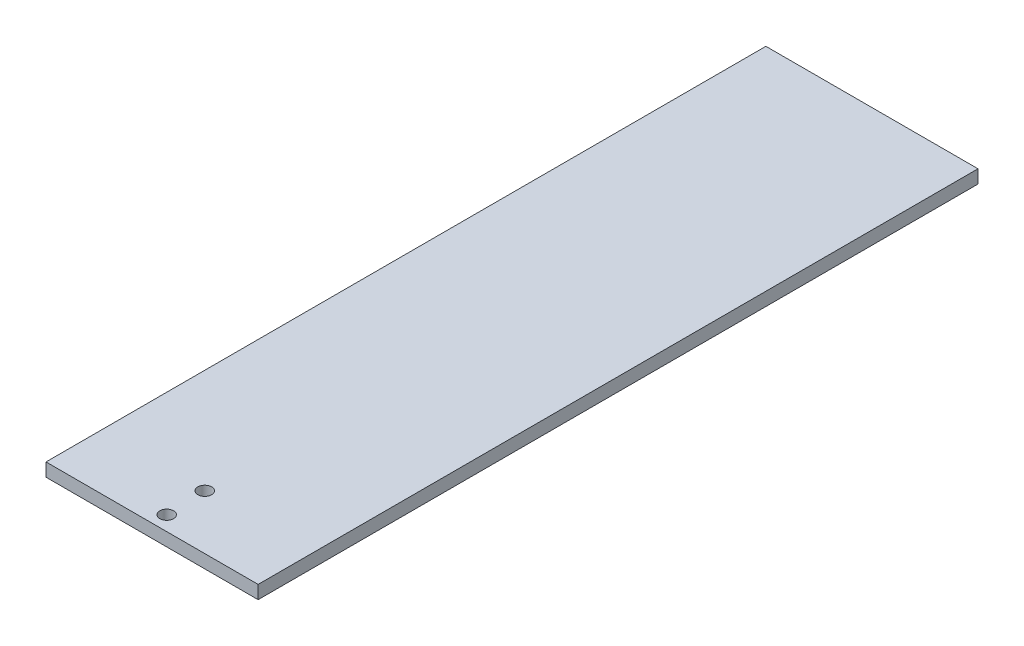
ISO-10303-21;
HEADER;
FILE_DESCRIPTION(('STEP AP214'),'2;1');
FILE_NAME('part.step','',(''),(''),'','','');
FILE_SCHEMA(('AUTOMOTIVE_DESIGN { 1 0 10303 214 1 1 1 1 }'));
ENDSEC;
DATA;
#1=APPLICATION_CONTEXT('core data for automotive mechanical design processes');
#2=APPLICATION_PROTOCOL_DEFINITION('international standard','automotive_design',2000,#1);
#3=PRODUCT_CONTEXT('',#1,'mechanical');
#4=PRODUCT('Part','Part','',(#3));
#5=PRODUCT_RELATED_PRODUCT_CATEGORY('part','',(#4));
#6=PRODUCT_DEFINITION_FORMATION('','',#4);
#7=PRODUCT_DEFINITION_CONTEXT('part definition',#1,'design');
#8=PRODUCT_DEFINITION('design','',#6,#7);
#9=PRODUCT_DEFINITION_SHAPE('','',#8);
#10=(LENGTH_UNIT() NAMED_UNIT(*) SI_UNIT(.MILLI.,.METRE.));
#11=(NAMED_UNIT(*) PLANE_ANGLE_UNIT() SI_UNIT($,.RADIAN.));
#12=(NAMED_UNIT(*) SI_UNIT($,.STERADIAN.) SOLID_ANGLE_UNIT());
#13=UNCERTAINTY_MEASURE_WITH_UNIT(LENGTH_MEASURE(1.E-05),#10,'distance_accuracy_value','');
#14=(GEOMETRIC_REPRESENTATION_CONTEXT(3) GLOBAL_UNCERTAINTY_ASSIGNED_CONTEXT((#13)) GLOBAL_UNIT_ASSIGNED_CONTEXT((#10,
#11,#12)) REPRESENTATION_CONTEXT('',''));
#15=CARTESIAN_POINT('',(0.,0.,0.));
#16=DIRECTION('',(0.,0.,1.));
#17=DIRECTION('',(1.,0.,0.));
#18=AXIS2_PLACEMENT_3D('',#15,#16,#17);
#19=CARTESIAN_POINT('',(0.,6.35,0.));
#20=DIRECTION('',(1.,0.,0.));
#21=DIRECTION('',(0.,0.,-1.));
#22=AXIS2_PLACEMENT_3D('',#19,#20,#21);
#23=PLANE('',#22);
#24=DIRECTION('',(0.,0.,1.));
#25=VECTOR('',#24,1.);
#26=CARTESIAN_POINT('',(0.,0.,0.));
#27=LINE('',#26,#25);
#28=CARTESIAN_POINT('',(0.,0.,-344.8));
#29=VERTEX_POINT('',#28);
#30=CARTESIAN_POINT('',(0.,0.,0.));
#31=VERTEX_POINT('',#30);
#32=EDGE_CURVE('E101',#29,#31,#27,.T.);
#33=ORIENTED_EDGE('',*,*,#32,.T.);
#34=DIRECTION('',(0.,-1.,0.));
#35=VECTOR('',#34,1.);
#36=CARTESIAN_POINT('',(0.,6.35,0.));
#37=LINE('',#36,#35);
#38=CARTESIAN_POINT('',(0.,6.35,0.));
#39=VERTEX_POINT('',#38);
#40=EDGE_CURVE('E11',#39,#31,#37,.T.);
#41=ORIENTED_EDGE('',*,*,#40,.F.);
#42=DIRECTION('',(0.,0.,1.));
#43=VECTOR('',#42,1.);
#44=CARTESIAN_POINT('',(0.,6.35,0.));
#45=LINE('',#44,#43);
#46=CARTESIAN_POINT('',(0.,6.35,-344.8));
#47=VERTEX_POINT('',#46);
#48=EDGE_CURVE('E89',#47,#39,#45,.T.);
#49=ORIENTED_EDGE('',*,*,#48,.F.);
#50=DIRECTION('',(0.,-1.,0.));
#51=VECTOR('',#50,1.);
#52=CARTESIAN_POINT('',(0.,6.35,-344.8));
#53=LINE('',#52,#51);
#54=EDGE_CURVE('E97',#47,#29,#53,.T.);
#55=ORIENTED_EDGE('',*,*,#54,.T.);
#56=EDGE_LOOP('',(#33,#41,#49,#55));
#57=FACE_BOUND('',#56,.T.);
#58=ADVANCED_FACE('F38',(#57),#23,.F.);
#59=CARTESIAN_POINT('',(0.,6.35,0.));
#60=DIRECTION('',(0.,0.,-1.));
#61=DIRECTION('',(-1.,0.,0.));
#62=AXIS2_PLACEMENT_3D('',#59,#60,#61);
#63=PLANE('',#62);
#64=DIRECTION('',(1.,0.,0.));
#65=VECTOR('',#64,1.);
#66=CARTESIAN_POINT('',(0.,0.,0.));
#67=LINE('',#66,#65);
#68=CARTESIAN_POINT('',(101.6,0.,0.));
#69=VERTEX_POINT('',#68);
#70=EDGE_CURVE('E93',#31,#69,#67,.T.);
#71=ORIENTED_EDGE('',*,*,#70,.T.);
#72=DIRECTION('',(0.,-1.,0.));
#73=VECTOR('',#72,1.);
#74=CARTESIAN_POINT('',(101.6,6.35,0.));
#75=LINE('',#74,#73);
#76=CARTESIAN_POINT('',(101.6,6.35,0.));
#77=VERTEX_POINT('',#76);
#78=EDGE_CURVE('E46',#77,#69,#75,.T.);
#79=ORIENTED_EDGE('',*,*,#78,.F.);
#80=DIRECTION('',(1.,0.,0.));
#81=VECTOR('',#80,1.);
#82=CARTESIAN_POINT('',(0.,6.35,0.));
#83=LINE('',#82,#81);
#84=EDGE_CURVE('E84',#39,#77,#83,.T.);
#85=ORIENTED_EDGE('',*,*,#84,.F.);
#86=ORIENTED_EDGE('',*,*,#40,.T.);
#87=EDGE_LOOP('',(#71,#79,#85,#86));
#88=FACE_BOUND('',#87,.T.);
#89=ADVANCED_FACE('F92',(#88),#63,.F.);
#90=CARTESIAN_POINT('',(101.6,6.35,0.));
#91=DIRECTION('',(-1.,0.,0.));
#92=DIRECTION('',(0.,0.,1.));
#93=AXIS2_PLACEMENT_3D('',#90,#91,#92);
#94=PLANE('',#93);
#95=DIRECTION('',(0.,0.,-1.));
#96=VECTOR('',#95,1.);
#97=CARTESIAN_POINT('',(101.6,0.,0.));
#98=LINE('',#97,#96);
#99=CARTESIAN_POINT('',(101.6,0.,-344.8));
#100=VERTEX_POINT('',#99);
#101=EDGE_CURVE('E71',#69,#100,#98,.T.);
#102=ORIENTED_EDGE('',*,*,#101,.T.);
#103=DIRECTION('',(0.,-1.,0.));
#104=VECTOR('',#103,1.);
#105=CARTESIAN_POINT('',(101.6,6.35,-344.8));
#106=LINE('',#105,#104);
#107=CARTESIAN_POINT('',(101.6,6.35,-344.8));
#108=VERTEX_POINT('',#107);
#109=EDGE_CURVE('E94',#108,#100,#106,.T.);
#110=ORIENTED_EDGE('',*,*,#109,.F.);
#111=DIRECTION('',(0.,0.,-1.));
#112=VECTOR('',#111,1.);
#113=CARTESIAN_POINT('',(101.6,6.35,0.));
#114=LINE('',#113,#112);
#115=EDGE_CURVE('E87',#77,#108,#114,.T.);
#116=ORIENTED_EDGE('',*,*,#115,.F.);
#117=ORIENTED_EDGE('',*,*,#78,.T.);
#118=EDGE_LOOP('',(#102,#110,#116,#117));
#119=FACE_BOUND('',#118,.T.);
#120=ADVANCED_FACE('F95',(#119),#94,.F.);
#121=CARTESIAN_POINT('',(0.,6.35,-344.8));
#122=DIRECTION('',(0.,0.,1.));
#123=DIRECTION('',(1.,0.,0.));
#124=AXIS2_PLACEMENT_3D('',#121,#122,#123);
#125=PLANE('',#124);
#126=DIRECTION('',(-1.,0.,0.));
#127=VECTOR('',#126,1.);
#128=CARTESIAN_POINT('',(0.,0.,-344.8));
#129=LINE('',#128,#127);
#130=EDGE_CURVE('E77',#100,#29,#129,.T.);
#131=ORIENTED_EDGE('',*,*,#130,.T.);
#132=ORIENTED_EDGE('',*,*,#54,.F.);
#133=DIRECTION('',(-1.,0.,0.));
#134=VECTOR('',#133,1.);
#135=CARTESIAN_POINT('',(0.,6.35,-344.8));
#136=LINE('',#135,#134);
#137=EDGE_CURVE('E54',#108,#47,#136,.T.);
#138=ORIENTED_EDGE('',*,*,#137,.F.);
#139=ORIENTED_EDGE('',*,*,#109,.T.);
#140=EDGE_LOOP('',(#131,#132,#138,#139));
#141=FACE_BOUND('',#140,.T.);
#142=ADVANCED_FACE('F109',(#141),#125,.F.);
#143=CARTESIAN_POINT('',(0.,6.35,0.));
#144=DIRECTION('',(0.,-1.,0.));
#145=DIRECTION('',(0.,0.,-1.));
#146=AXIS2_PLACEMENT_3D('',#143,#144,#145);
#147=PLANE('',#146);
#148=CARTESIAN_POINT('',(50.00070449196,6.35,-26.0332242852026));
#149=DIRECTION('',(0.,1.,0.));
#150=DIRECTION('',(0.,0.,1.));
#151=AXIS2_PLACEMENT_3D('',#148,#149,#150);
#152=CIRCLE('',#151,3.3);
#153=CARTESIAN_POINT('',(50.00070449196,6.35,-22.7332242852026));
#154=VERTEX_POINT('',#153);
#155=EDGE_CURVE('E123',#154,#154,#152,.T.);
#156=ORIENTED_EDGE('',*,*,#155,.F.);
#157=EDGE_LOOP('',(#156));
#158=FACE_BOUND('',#157,.T.);
#159=CARTESIAN_POINT('',(50.8,6.35,-7.));
#160=DIRECTION('',(0.,1.,0.));
#161=DIRECTION('',(0.,0.,1.));
#162=AXIS2_PLACEMENT_3D('',#159,#160,#161);
#163=CIRCLE('',#162,3.3);
#164=CARTESIAN_POINT('',(50.8,6.35,-3.70000000000001));
#165=VERTEX_POINT('',#164);
#166=EDGE_CURVE('E117',#165,#165,#163,.T.);
#167=ORIENTED_EDGE('',*,*,#166,.F.);
#168=EDGE_LOOP('',(#167));
#169=FACE_BOUND('',#168,.T.);
#170=ORIENTED_EDGE('',*,*,#48,.T.);
#171=ORIENTED_EDGE('',*,*,#84,.T.);
#172=ORIENTED_EDGE('',*,*,#115,.T.);
#173=ORIENTED_EDGE('',*,*,#137,.T.);
#174=EDGE_LOOP('',(#170,#171,#172,#173));
#175=FACE_BOUND('',#174,.T.);
#176=ADVANCED_FACE('F85',(#158,#169,#175),#147,.F.);
#177=CARTESIAN_POINT('',(0.,0.,0.));
#178=DIRECTION('',(0.,-1.,0.));
#179=DIRECTION('',(0.,0.,-1.));
#180=AXIS2_PLACEMENT_3D('',#177,#178,#179);
#181=PLANE('',#180);
#182=CARTESIAN_POINT('',(50.00070449196,0.,-26.0332242852026));
#183=DIRECTION('',(0.,-1.,0.));
#184=DIRECTION('',(0.,0.,-1.));
#185=AXIS2_PLACEMENT_3D('',#182,#183,#184);
#186=CIRCLE('',#185,3.3);
#187=CARTESIAN_POINT('',(50.00070449196,0.,-29.3332242852026));
#188=VERTEX_POINT('',#187);
#189=EDGE_CURVE('E120',#188,#188,#186,.T.);
#190=ORIENTED_EDGE('',*,*,#189,.F.);
#191=EDGE_LOOP('',(#190));
#192=FACE_BOUND('',#191,.T.);
#193=CARTESIAN_POINT('',(50.8,0.,-7.));
#194=DIRECTION('',(0.,-1.,0.));
#195=DIRECTION('',(0.,0.,-1.));
#196=AXIS2_PLACEMENT_3D('',#193,#194,#195);
#197=CIRCLE('',#196,3.3);
#198=CARTESIAN_POINT('',(50.8,0.,-10.3));
#199=VERTEX_POINT('',#198);
#200=EDGE_CURVE('E104',#199,#199,#197,.T.);
#201=ORIENTED_EDGE('',*,*,#200,.F.);
#202=EDGE_LOOP('',(#201));
#203=FACE_BOUND('',#202,.T.);
#204=ORIENTED_EDGE('',*,*,#32,.F.);
#205=ORIENTED_EDGE('',*,*,#130,.F.);
#206=ORIENTED_EDGE('',*,*,#101,.F.);
#207=ORIENTED_EDGE('',*,*,#70,.F.);
#208=EDGE_LOOP('',(#204,#205,#206,#207));
#209=FACE_BOUND('',#208,.T.);
#210=ADVANCED_FACE('F112',(#192,#203,#209),#181,.T.);
#211=CARTESIAN_POINT('',(50.8,6.35,-7.));
#212=DIRECTION('',(0.,1.,0.));
#213=DIRECTION('',(0.,0.,1.));
#214=AXIS2_PLACEMENT_3D('',#211,#212,#213);
#215=CYLINDRICAL_SURFACE('',#214,3.3);
#216=ORIENTED_EDGE('',*,*,#200,.T.);
#217=EDGE_LOOP('',(#216));
#218=FACE_BOUND('',#217,.T.);
#219=ORIENTED_EDGE('',*,*,#166,.T.);
#220=EDGE_LOOP('',(#219));
#221=FACE_BOUND('',#220,.T.);
#222=ADVANCED_FACE('F134',(#218,#221),#215,.F.);
#223=CARTESIAN_POINT('',(50.00070449196,6.35,-26.0332242852026));
#224=DIRECTION('',(0.,1.,0.));
#225=DIRECTION('',(0.,0.,1.));
#226=AXIS2_PLACEMENT_3D('',#223,#224,#225);
#227=CYLINDRICAL_SURFACE('',#226,3.3);
#228=ORIENTED_EDGE('',*,*,#189,.T.);
#229=EDGE_LOOP('',(#228));
#230=FACE_BOUND('',#229,.T.);
#231=ORIENTED_EDGE('',*,*,#155,.T.);
#232=EDGE_LOOP('',(#231));
#233=FACE_BOUND('',#232,.T.);
#234=ADVANCED_FACE('F127',(#230,#233),#227,.F.);
#235=CLOSED_SHELL('',(#58,#89,#120,#142,#176,#210,#222,#234));
#236=MANIFOLD_SOLID_BREP('B2',#235);
#237=ADVANCED_BREP_SHAPE_REPRESENTATION('',(#18,#236),#14);
#238=SHAPE_DEFINITION_REPRESENTATION(#9,#237);
ENDSEC;
END-ISO-10303-21;
